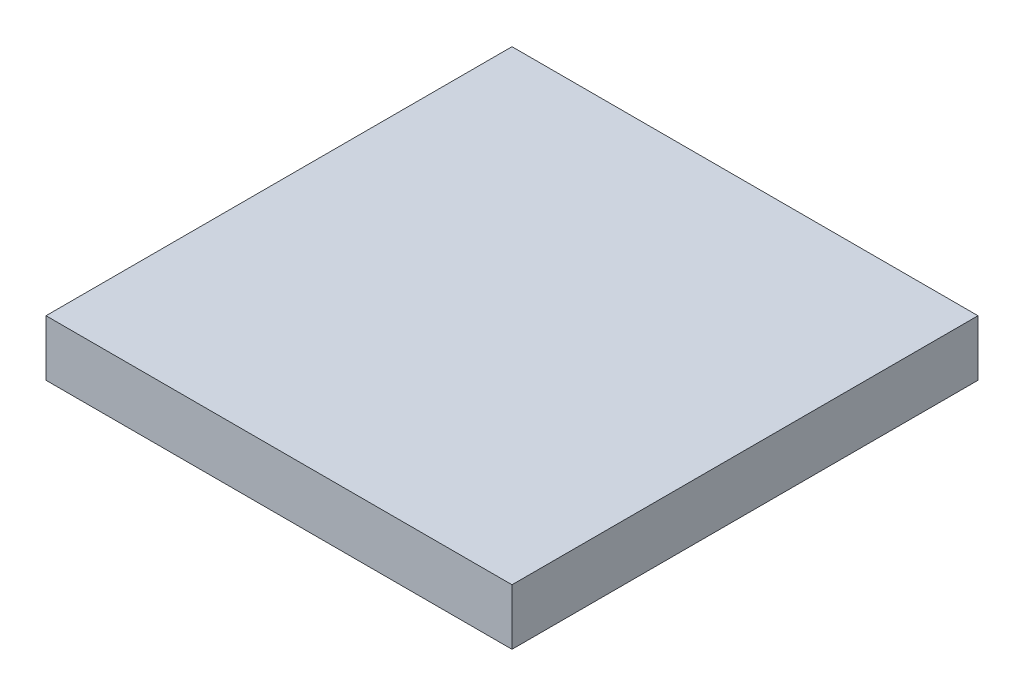
ISO-10303-21;
HEADER;
FILE_DESCRIPTION(('STEP AP214'),'2;1');
FILE_NAME('part.step','',(''),(''),'','','');
FILE_SCHEMA(('AUTOMOTIVE_DESIGN { 1 0 10303 214 1 1 1 1 }'));
ENDSEC;
DATA;
#1=APPLICATION_CONTEXT('core data for automotive mechanical design processes');
#2=APPLICATION_PROTOCOL_DEFINITION('international standard','automotive_design',2000,#1);
#3=PRODUCT_CONTEXT('',#1,'mechanical');
#4=PRODUCT('Part','Part','',(#3));
#5=PRODUCT_RELATED_PRODUCT_CATEGORY('part','',(#4));
#6=PRODUCT_DEFINITION_FORMATION('','',#4);
#7=PRODUCT_DEFINITION_CONTEXT('part definition',#1,'design');
#8=PRODUCT_DEFINITION('design','',#6,#7);
#9=PRODUCT_DEFINITION_SHAPE('','',#8);
#10=(LENGTH_UNIT() NAMED_UNIT(*) SI_UNIT(.MILLI.,.METRE.));
#11=(NAMED_UNIT(*) PLANE_ANGLE_UNIT() SI_UNIT($,.RADIAN.));
#12=(NAMED_UNIT(*) SI_UNIT($,.STERADIAN.) SOLID_ANGLE_UNIT());
#13=UNCERTAINTY_MEASURE_WITH_UNIT(LENGTH_MEASURE(1.E-05),#10,'distance_accuracy_value','');
#14=(GEOMETRIC_REPRESENTATION_CONTEXT(3) GLOBAL_UNCERTAINTY_ASSIGNED_CONTEXT((#13)) GLOBAL_UNIT_ASSIGNED_CONTEXT((#10,
#11,#12)) REPRESENTATION_CONTEXT('',''));
#15=CARTESIAN_POINT('',(0.,0.,0.));
#16=DIRECTION('',(0.,0.,1.));
#17=DIRECTION('',(1.,0.,0.));
#18=AXIS2_PLACEMENT_3D('',#15,#16,#17);
#19=CARTESIAN_POINT('',(0.,0.,0.));
#20=DIRECTION('',(0.,-1.,0.));
#21=DIRECTION('',(0.,0.,-1.));
#22=AXIS2_PLACEMENT_3D('',#19,#20,#21);
#23=PLANE('',#22);
#24=CARTESIAN_POINT('',(-10.5,0.,-10.5));
#25=DIRECTION('',(0.,-1.,0.));
#26=DIRECTION('',(0.,0.,-1.));
#27=AXIS2_PLACEMENT_3D('',#24,#25,#26);
#28=CIRCLE('',#27,1.25);
#29=CARTESIAN_POINT('',(-10.5,0.,-11.75));
#30=VERTEX_POINT('',#29);
#31=EDGE_CURVE('E128',#30,#30,#28,.T.);
#32=ORIENTED_EDGE('',*,*,#31,.F.);
#33=EDGE_LOOP('',(#32));
#34=FACE_BOUND('',#33,.T.);
#35=CARTESIAN_POINT('',(10.5,0.,-10.5));
#36=DIRECTION('',(0.,-1.,0.));
#37=DIRECTION('',(0.,0.,-1.));
#38=AXIS2_PLACEMENT_3D('',#35,#36,#37);
#39=CIRCLE('',#38,1.25);
#40=CARTESIAN_POINT('',(10.5,0.,-11.75));
#41=VERTEX_POINT('',#40);
#42=EDGE_CURVE('E134',#41,#41,#39,.T.);
#43=ORIENTED_EDGE('',*,*,#42,.F.);
#44=EDGE_LOOP('',(#43));
#45=FACE_BOUND('',#44,.T.);
#46=CARTESIAN_POINT('',(10.5,0.,10.5));
#47=DIRECTION('',(0.,-1.,0.));
#48=DIRECTION('',(0.,0.,-1.));
#49=AXIS2_PLACEMENT_3D('',#46,#47,#48);
#50=CIRCLE('',#49,1.25);
#51=CARTESIAN_POINT('',(10.5,0.,9.25));
#52=VERTEX_POINT('',#51);
#53=EDGE_CURVE('E140',#52,#52,#50,.T.);
#54=ORIENTED_EDGE('',*,*,#53,.F.);
#55=EDGE_LOOP('',(#54));
#56=FACE_BOUND('',#55,.T.);
#57=CARTESIAN_POINT('',(-10.5,0.,10.5));
#58=DIRECTION('',(0.,-1.,0.));
#59=DIRECTION('',(0.,0.,-1.));
#60=AXIS2_PLACEMENT_3D('',#57,#58,#59);
#61=CIRCLE('',#60,1.25);
#62=CARTESIAN_POINT('',(-10.5,0.,9.25));
#63=VERTEX_POINT('',#62);
#64=EDGE_CURVE('E122',#63,#63,#61,.T.);
#65=ORIENTED_EDGE('',*,*,#64,.F.);
#66=EDGE_LOOP('',(#65));
#67=FACE_BOUND('',#66,.T.);
#68=DIRECTION('',(0.,0.,-1.));
#69=VECTOR('',#68,1.);
#70=CARTESIAN_POINT('',(12.5,0.,12.5));
#71=LINE('',#70,#69);
#72=CARTESIAN_POINT('',(12.5,0.,12.5));
#73=VERTEX_POINT('',#72);
#74=CARTESIAN_POINT('',(12.5,0.,-12.5));
#75=VERTEX_POINT('',#74);
#76=EDGE_CURVE('E99',#73,#75,#71,.T.);
#77=ORIENTED_EDGE('',*,*,#76,.F.);
#78=DIRECTION('',(1.,0.,0.));
#79=VECTOR('',#78,1.);
#80=CARTESIAN_POINT('',(-12.5,0.,12.5));
#81=LINE('',#80,#79);
#82=CARTESIAN_POINT('',(-12.5,0.,12.5));
#83=VERTEX_POINT('',#82);
#84=EDGE_CURVE('E74',#83,#73,#81,.T.);
#85=ORIENTED_EDGE('',*,*,#84,.F.);
#86=DIRECTION('',(0.,0.,1.));
#87=VECTOR('',#86,1.);
#88=CARTESIAN_POINT('',(-12.5,0.,12.5));
#89=LINE('',#88,#87);
#90=CARTESIAN_POINT('',(-12.5,0.,-12.5));
#91=VERTEX_POINT('',#90);
#92=EDGE_CURVE('E68',#91,#83,#89,.T.);
#93=ORIENTED_EDGE('',*,*,#92,.F.);
#94=DIRECTION('',(-1.,0.,0.));
#95=VECTOR('',#94,1.);
#96=CARTESIAN_POINT('',(-12.5,0.,-12.5));
#97=LINE('',#96,#95);
#98=EDGE_CURVE('E90',#75,#91,#97,.T.);
#99=ORIENTED_EDGE('',*,*,#98,.F.);
#100=EDGE_LOOP('',(#77,#85,#93,#99));
#101=FACE_BOUND('',#100,.T.);
#102=CARTESIAN_POINT('',(0.,0.,0.));
#103=DIRECTION('',(0.,-1.,0.));
#104=DIRECTION('',(0.,0.,-1.));
#105=AXIS2_PLACEMENT_3D('',#102,#103,#104);
#106=CIRCLE('',#105,10.);
#107=CARTESIAN_POINT('',(0.,0.,-10.));
#108=VERTEX_POINT('',#107);
#109=EDGE_CURVE('E37',#108,#108,#106,.F.);
#110=ORIENTED_EDGE('',*,*,#109,.T.);
#111=EDGE_LOOP('',(#110));
#112=FACE_BOUND('',#111,.T.);
#113=ADVANCED_FACE('F33',(#34,#45,#56,#67,#101,#112),#23,.T.);
#114=CARTESIAN_POINT('',(12.5,3.,12.5));
#115=DIRECTION('',(-1.,0.,0.));
#116=DIRECTION('',(0.,0.,1.));
#117=AXIS2_PLACEMENT_3D('',#114,#115,#116);
#118=PLANE('',#117);
#119=ORIENTED_EDGE('',*,*,#76,.T.);
#120=DIRECTION('',(0.,-1.,0.));
#121=VECTOR('',#120,1.);
#122=CARTESIAN_POINT('',(12.5,3.,-12.5));
#123=LINE('',#122,#121);
#124=CARTESIAN_POINT('',(12.5,3.,-12.5));
#125=VERTEX_POINT('',#124);
#126=EDGE_CURVE('E11',#125,#75,#123,.T.);
#127=ORIENTED_EDGE('',*,*,#126,.F.);
#128=DIRECTION('',(0.,0.,-1.));
#129=VECTOR('',#128,1.);
#130=CARTESIAN_POINT('',(12.5,3.,12.5));
#131=LINE('',#130,#129);
#132=CARTESIAN_POINT('',(12.5,3.,12.5));
#133=VERTEX_POINT('',#132);
#134=EDGE_CURVE('E86',#133,#125,#131,.T.);
#135=ORIENTED_EDGE('',*,*,#134,.F.);
#136=DIRECTION('',(0.,-1.,0.));
#137=VECTOR('',#136,1.);
#138=CARTESIAN_POINT('',(12.5,3.,12.5));
#139=LINE('',#138,#137);
#140=EDGE_CURVE('E95',#133,#73,#139,.T.);
#141=ORIENTED_EDGE('',*,*,#140,.T.);
#142=EDGE_LOOP('',(#119,#127,#135,#141));
#143=FACE_BOUND('',#142,.T.);
#144=ADVANCED_FACE('F35',(#143),#118,.F.);
#145=CARTESIAN_POINT('',(-12.5,3.,-12.5));
#146=DIRECTION('',(0.,0.,1.));
#147=DIRECTION('',(1.,0.,0.));
#148=AXIS2_PLACEMENT_3D('',#145,#146,#147);
#149=PLANE('',#148);
#150=ORIENTED_EDGE('',*,*,#98,.T.);
#151=DIRECTION('',(0.,-1.,0.));
#152=VECTOR('',#151,1.);
#153=CARTESIAN_POINT('',(-12.5,3.,-12.5));
#154=LINE('',#153,#152);
#155=CARTESIAN_POINT('',(-12.5,3.,-12.5));
#156=VERTEX_POINT('',#155);
#157=EDGE_CURVE('E43',#156,#91,#154,.T.);
#158=ORIENTED_EDGE('',*,*,#157,.F.);
#159=DIRECTION('',(-1.,0.,0.));
#160=VECTOR('',#159,1.);
#161=CARTESIAN_POINT('',(-12.5,3.,-12.5));
#162=LINE('',#161,#160);
#163=EDGE_CURVE('E81',#125,#156,#162,.T.);
#164=ORIENTED_EDGE('',*,*,#163,.F.);
#165=ORIENTED_EDGE('',*,*,#126,.T.);
#166=EDGE_LOOP('',(#150,#158,#164,#165));
#167=FACE_BOUND('',#166,.T.);
#168=ADVANCED_FACE('F89',(#167),#149,.F.);
#169=CARTESIAN_POINT('',(-12.5,3.,12.5));
#170=DIRECTION('',(1.,0.,0.));
#171=DIRECTION('',(0.,0.,-1.));
#172=AXIS2_PLACEMENT_3D('',#169,#170,#171);
#173=PLANE('',#172);
#174=ORIENTED_EDGE('',*,*,#92,.T.);
#175=DIRECTION('',(0.,-1.,0.));
#176=VECTOR('',#175,1.);
#177=CARTESIAN_POINT('',(-12.5,3.,12.5));
#178=LINE('',#177,#176);
#179=CARTESIAN_POINT('',(-12.5,3.,12.5));
#180=VERTEX_POINT('',#179);
#181=EDGE_CURVE('E91',#180,#83,#178,.T.);
#182=ORIENTED_EDGE('',*,*,#181,.F.);
#183=DIRECTION('',(0.,0.,1.));
#184=VECTOR('',#183,1.);
#185=CARTESIAN_POINT('',(-12.5,3.,12.5));
#186=LINE('',#185,#184);
#187=EDGE_CURVE('E84',#156,#180,#186,.T.);
#188=ORIENTED_EDGE('',*,*,#187,.F.);
#189=ORIENTED_EDGE('',*,*,#157,.T.);
#190=EDGE_LOOP('',(#174,#182,#188,#189));
#191=FACE_BOUND('',#190,.T.);
#192=ADVANCED_FACE('F93',(#191),#173,.F.);
#193=CARTESIAN_POINT('',(-12.5,3.,12.5));
#194=DIRECTION('',(0.,0.,-1.));
#195=DIRECTION('',(-1.,0.,0.));
#196=AXIS2_PLACEMENT_3D('',#193,#194,#195);
#197=PLANE('',#196);
#198=ORIENTED_EDGE('',*,*,#84,.T.);
#199=ORIENTED_EDGE('',*,*,#140,.F.);
#200=DIRECTION('',(1.,0.,0.));
#201=VECTOR('',#200,1.);
#202=CARTESIAN_POINT('',(-12.5,3.,12.5));
#203=LINE('',#202,#201);
#204=EDGE_CURVE('E51',#180,#133,#203,.T.);
#205=ORIENTED_EDGE('',*,*,#204,.F.);
#206=ORIENTED_EDGE('',*,*,#181,.T.);
#207=EDGE_LOOP('',(#198,#199,#205,#206));
#208=FACE_BOUND('',#207,.T.);
#209=ADVANCED_FACE('F106',(#208),#197,.F.);
#210=CARTESIAN_POINT('',(0.,3.,0.));
#211=DIRECTION('',(0.,-1.,0.));
#212=DIRECTION('',(0.,0.,-1.));
#213=AXIS2_PLACEMENT_3D('',#210,#211,#212);
#214=PLANE('',#213);
#215=ORIENTED_EDGE('',*,*,#134,.T.);
#216=ORIENTED_EDGE('',*,*,#163,.T.);
#217=ORIENTED_EDGE('',*,*,#187,.T.);
#218=ORIENTED_EDGE('',*,*,#204,.T.);
#219=EDGE_LOOP('',(#215,#216,#217,#218));
#220=FACE_BOUND('',#219,.T.);
#221=ADVANCED_FACE('F82',(#220),#214,.F.);
#222=CARTESIAN_POINT('',(0.,2.,0.));
#223=DIRECTION('',(0.,-1.,0.));
#224=DIRECTION('',(0.,0.,-1.));
#225=AXIS2_PLACEMENT_3D('',#222,#223,#224);
#226=CYLINDRICAL_SURFACE('',#225,10.);
#227=ORIENTED_EDGE('',*,*,#109,.F.);
#228=EDGE_LOOP('',(#227));
#229=FACE_BOUND('',#228,.T.);
#230=CARTESIAN_POINT('',(0.,2.,0.));
#231=DIRECTION('',(0.,1.,0.));
#232=DIRECTION('',(0.,0.,1.));
#233=AXIS2_PLACEMENT_3D('',#230,#231,#232);
#234=CIRCLE('',#233,10.);
#235=CARTESIAN_POINT('',(0.,2.,10.));
#236=VERTEX_POINT('',#235);
#237=EDGE_CURVE('E112',#236,#236,#234,.T.);
#238=ORIENTED_EDGE('',*,*,#237,.T.);
#239=EDGE_LOOP('',(#238));
#240=FACE_BOUND('',#239,.T.);
#241=ADVANCED_FACE('F183',(#229,#240),#226,.F.);
#242=CARTESIAN_POINT('',(0.,2.,0.));
#243=DIRECTION('',(0.,1.,0.));
#244=DIRECTION('',(0.,0.,1.));
#245=AXIS2_PLACEMENT_3D('',#242,#243,#244);
#246=PLANE('',#245);
#247=CARTESIAN_POINT('',(0.,2.,0.));
#248=DIRECTION('',(0.,1.,0.));
#249=DIRECTION('',(0.,0.,1.));
#250=AXIS2_PLACEMENT_3D('',#247,#248,#249);
#251=CIRCLE('',#250,5.5);
#252=CARTESIAN_POINT('',(0.,2.,5.5));
#253=VERTEX_POINT('',#252);
#254=EDGE_CURVE('E116',#253,#253,#251,.T.);
#255=ORIENTED_EDGE('',*,*,#254,.T.);
#256=EDGE_LOOP('',(#255));
#257=FACE_BOUND('',#256,.T.);
#258=ORIENTED_EDGE('',*,*,#237,.F.);
#259=EDGE_LOOP('',(#258));
#260=FACE_BOUND('',#259,.T.);
#261=ADVANCED_FACE('F179',(#257,#260),#246,.F.);
#262=CARTESIAN_POINT('',(0.,0.,0.));
#263=DIRECTION('',(0.,1.,0.));
#264=DIRECTION('',(0.,0.,1.));
#265=AXIS2_PLACEMENT_3D('',#262,#263,#264);
#266=CYLINDRICAL_SURFACE('',#265,5.5);
#267=CARTESIAN_POINT('',(0.,0.,0.));
#268=DIRECTION('',(0.,1.,0.));
#269=DIRECTION('',(0.,0.,1.));
#270=AXIS2_PLACEMENT_3D('',#267,#268,#269);
#271=CIRCLE('',#270,5.5);
#272=CARTESIAN_POINT('',(0.,0.,5.5));
#273=VERTEX_POINT('',#272);
#274=EDGE_CURVE('E115',#273,#273,#271,.T.);
#275=ORIENTED_EDGE('',*,*,#274,.T.);
#276=EDGE_LOOP('',(#275));
#277=FACE_BOUND('',#276,.T.);
#278=ORIENTED_EDGE('',*,*,#254,.F.);
#279=EDGE_LOOP('',(#278));
#280=FACE_BOUND('',#279,.T.);
#281=ADVANCED_FACE('F173',(#277,#280),#266,.T.);
#282=ORIENTED_EDGE('',*,*,#274,.F.);
#283=EDGE_LOOP('',(#282));
#284=FACE_BOUND('',#283,.T.);
#285=ADVANCED_FACE('F159',(#284),#23,.T.);
#286=CARTESIAN_POINT('',(-10.5,2.,10.5));
#287=DIRECTION('',(0.,-1.,0.));
#288=DIRECTION('',(0.,0.,-1.));
#289=AXIS2_PLACEMENT_3D('',#286,#287,#288);
#290=CYLINDRICAL_SURFACE('',#289,1.25);
#291=CARTESIAN_POINT('',(-10.5,2.,10.5));
#292=DIRECTION('',(0.,-1.,0.));
#293=DIRECTION('',(0.,0.,-1.));
#294=AXIS2_PLACEMENT_3D('',#291,#292,#293);
#295=CIRCLE('',#294,1.25);
#296=CARTESIAN_POINT('',(-10.5,2.,9.25));
#297=VERTEX_POINT('',#296);
#298=EDGE_CURVE('E119',#297,#297,#295,.T.);
#299=ORIENTED_EDGE('',*,*,#298,.F.);
#300=EDGE_LOOP('',(#299));
#301=FACE_BOUND('',#300,.T.);
#302=ORIENTED_EDGE('',*,*,#64,.T.);
#303=EDGE_LOOP('',(#302));
#304=FACE_BOUND('',#303,.T.);
#305=ADVANCED_FACE('F162',(#301,#304),#290,.F.);
#306=CARTESIAN_POINT('',(-10.5,2.,10.5));
#307=DIRECTION('',(0.,-1.,0.));
#308=DIRECTION('',(0.,0.,-1.));
#309=AXIS2_PLACEMENT_3D('',#306,#307,#308);
#310=PLANE('',#309);
#311=ORIENTED_EDGE('',*,*,#298,.T.);
#312=EDGE_LOOP('',(#311));
#313=FACE_BOUND('',#312,.T.);
#314=ADVANCED_FACE('F151',(#313),#310,.T.);
#315=CARTESIAN_POINT('',(10.5,2.,10.5));
#316=DIRECTION('',(0.,-1.,0.));
#317=DIRECTION('',(0.,0.,-1.));
#318=AXIS2_PLACEMENT_3D('',#315,#316,#317);
#319=CYLINDRICAL_SURFACE('',#318,1.25);
#320=CARTESIAN_POINT('',(10.5,2.,10.5));
#321=DIRECTION('',(0.,-1.,0.));
#322=DIRECTION('',(0.,0.,-1.));
#323=AXIS2_PLACEMENT_3D('',#320,#321,#322);
#324=CIRCLE('',#323,1.25);
#325=CARTESIAN_POINT('',(10.5,2.,9.25));
#326=VERTEX_POINT('',#325);
#327=EDGE_CURVE('E125',#326,#326,#324,.T.);
#328=ORIENTED_EDGE('',*,*,#327,.F.);
#329=EDGE_LOOP('',(#328));
#330=FACE_BOUND('',#329,.T.);
#331=ORIENTED_EDGE('',*,*,#53,.T.);
#332=EDGE_LOOP('',(#331));
#333=FACE_BOUND('',#332,.T.);
#334=ADVANCED_FACE('F148',(#330,#333),#319,.F.);
#335=CARTESIAN_POINT('',(10.5,2.,10.5));
#336=DIRECTION('',(0.,-1.,0.));
#337=DIRECTION('',(0.,0.,-1.));
#338=AXIS2_PLACEMENT_3D('',#335,#336,#337);
#339=PLANE('',#338);
#340=ORIENTED_EDGE('',*,*,#327,.T.);
#341=EDGE_LOOP('',(#340));
#342=FACE_BOUND('',#341,.T.);
#343=ADVANCED_FACE('F146',(#342),#339,.T.);
#344=CARTESIAN_POINT('',(10.5,2.,-10.5));
#345=DIRECTION('',(0.,-1.,0.));
#346=DIRECTION('',(0.,0.,-1.));
#347=AXIS2_PLACEMENT_3D('',#344,#345,#346);
#348=CYLINDRICAL_SURFACE('',#347,1.25);
#349=CARTESIAN_POINT('',(10.5,2.,-10.5));
#350=DIRECTION('',(0.,-1.,0.));
#351=DIRECTION('',(0.,0.,-1.));
#352=AXIS2_PLACEMENT_3D('',#349,#350,#351);
#353=CIRCLE('',#352,1.25);
#354=CARTESIAN_POINT('',(10.5,2.,-11.75));
#355=VERTEX_POINT('',#354);
#356=EDGE_CURVE('E137',#355,#355,#353,.T.);
#357=ORIENTED_EDGE('',*,*,#356,.F.);
#358=EDGE_LOOP('',(#357));
#359=FACE_BOUND('',#358,.T.);
#360=ORIENTED_EDGE('',*,*,#42,.T.);
#361=EDGE_LOOP('',(#360));
#362=FACE_BOUND('',#361,.T.);
#363=ADVANCED_FACE('F274',(#359,#362),#348,.F.);
#364=CARTESIAN_POINT('',(10.5,2.,-10.5));
#365=DIRECTION('',(0.,-1.,0.));
#366=DIRECTION('',(0.,0.,-1.));
#367=AXIS2_PLACEMENT_3D('',#364,#365,#366);
#368=PLANE('',#367);
#369=ORIENTED_EDGE('',*,*,#356,.T.);
#370=EDGE_LOOP('',(#369));
#371=FACE_BOUND('',#370,.T.);
#372=ADVANCED_FACE('F283',(#371),#368,.T.);
#373=CARTESIAN_POINT('',(-10.5,2.,-10.5));
#374=DIRECTION('',(0.,-1.,0.));
#375=DIRECTION('',(0.,0.,-1.));
#376=AXIS2_PLACEMENT_3D('',#373,#374,#375);
#377=CYLINDRICAL_SURFACE('',#376,1.25);
#378=CARTESIAN_POINT('',(-10.5,2.,-10.5));
#379=DIRECTION('',(0.,-1.,0.));
#380=DIRECTION('',(0.,0.,-1.));
#381=AXIS2_PLACEMENT_3D('',#378,#379,#380);
#382=CIRCLE('',#381,1.25);
#383=CARTESIAN_POINT('',(-10.5,2.,-11.75));
#384=VERTEX_POINT('',#383);
#385=EDGE_CURVE('E131',#384,#384,#382,.T.);
#386=ORIENTED_EDGE('',*,*,#385,.F.);
#387=EDGE_LOOP('',(#386));
#388=FACE_BOUND('',#387,.T.);
#389=ORIENTED_EDGE('',*,*,#31,.T.);
#390=EDGE_LOOP('',(#389));
#391=FACE_BOUND('',#390,.T.);
#392=ADVANCED_FACE('F293',(#388,#391),#377,.F.);
#393=CARTESIAN_POINT('',(-10.5,2.,-10.5));
#394=DIRECTION('',(0.,-1.,0.));
#395=DIRECTION('',(0.,0.,-1.));
#396=AXIS2_PLACEMENT_3D('',#393,#394,#395);
#397=PLANE('',#396);
#398=ORIENTED_EDGE('',*,*,#385,.T.);
#399=EDGE_LOOP('',(#398));
#400=FACE_BOUND('',#399,.T.);
#401=ADVANCED_FACE('F303',(#400),#397,.T.);
#402=CLOSED_SHELL('',(#113,#144,#168,#192,#209,#221,#241,#261,#281,#285,#305,#314,#334,#343,
#363,#372,#392,#401));
#403=MANIFOLD_SOLID_BREP('B2',#402);
#404=ADVANCED_BREP_SHAPE_REPRESENTATION('',(#18,#403),#14);
#405=SHAPE_DEFINITION_REPRESENTATION(#9,#404);
ENDSEC;
END-ISO-10303-21;
